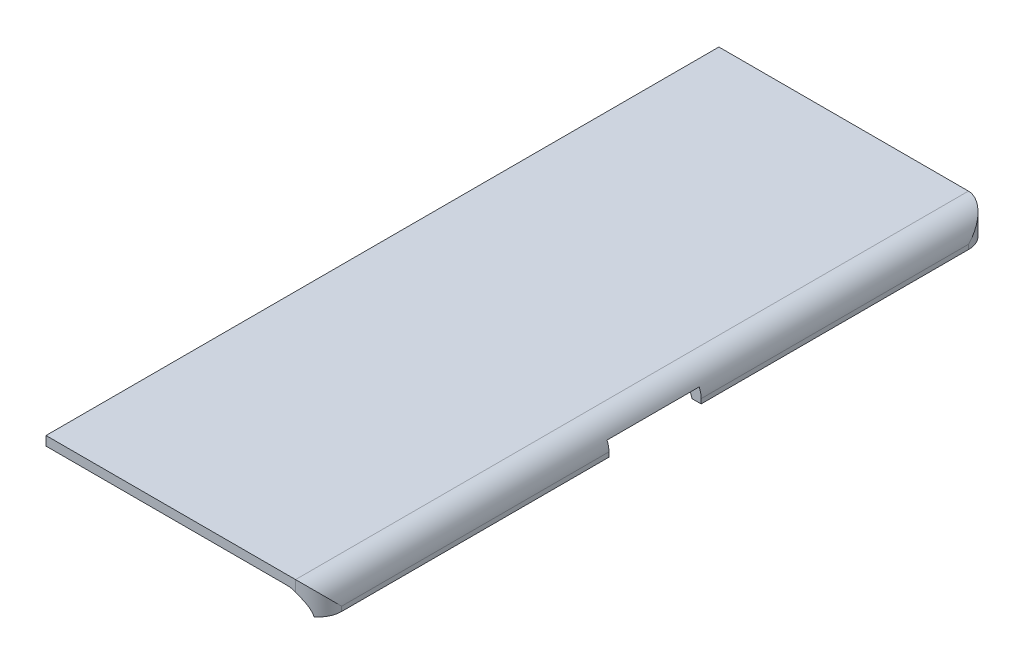
ISO-10303-21;
HEADER;
FILE_DESCRIPTION(('STEP AP214'),'2;1');
FILE_NAME('part.step','',(''),(''),'','','');
FILE_SCHEMA(('AUTOMOTIVE_DESIGN { 1 0 10303 214 1 1 1 1 }'));
ENDSEC;
DATA;
#1=APPLICATION_CONTEXT('core data for automotive mechanical design processes');
#2=APPLICATION_PROTOCOL_DEFINITION('international standard','automotive_design',2000,#1);
#3=PRODUCT_CONTEXT('',#1,'mechanical');
#4=PRODUCT('Part','Part','',(#3));
#5=PRODUCT_RELATED_PRODUCT_CATEGORY('part','',(#4));
#6=PRODUCT_DEFINITION_FORMATION('','',#4);
#7=PRODUCT_DEFINITION_CONTEXT('part definition',#1,'design');
#8=PRODUCT_DEFINITION('design','',#6,#7);
#9=PRODUCT_DEFINITION_SHAPE('','',#8);
#10=(LENGTH_UNIT() NAMED_UNIT(*) SI_UNIT(.MILLI.,.METRE.));
#11=(NAMED_UNIT(*) PLANE_ANGLE_UNIT() SI_UNIT($,.RADIAN.));
#12=(NAMED_UNIT(*) SI_UNIT($,.STERADIAN.) SOLID_ANGLE_UNIT());
#13=UNCERTAINTY_MEASURE_WITH_UNIT(LENGTH_MEASURE(1.E-05),#10,'distance_accuracy_value','');
#14=(GEOMETRIC_REPRESENTATION_CONTEXT(3) GLOBAL_UNCERTAINTY_ASSIGNED_CONTEXT((#13)) GLOBAL_UNIT_ASSIGNED_CONTEXT((#10,
#11,#12)) REPRESENTATION_CONTEXT('',''));
#15=CARTESIAN_POINT('',(0.,0.,0.));
#16=DIRECTION('',(0.,0.,1.));
#17=DIRECTION('',(1.,0.,0.));
#18=AXIS2_PLACEMENT_3D('',#15,#16,#17);
#19=CARTESIAN_POINT('',(2.,0.,0.));
#20=DIRECTION('',(1.,0.,0.));
#21=DIRECTION('',(0.,0.,-1.));
#22=AXIS2_PLACEMENT_3D('',#19,#20,#21);
#23=PLANE('',#22);
#24=DIRECTION('',(0.,1.,0.));
#25=VECTOR('',#24,1.);
#26=CARTESIAN_POINT('',(2.,2.,-141.));
#27=LINE('',#26,#25);
#28=CARTESIAN_POINT('',(2.,-4.,-141.));
#29=VERTEX_POINT('',#28);
#30=CARTESIAN_POINT('',(2.,-3.,-141.));
#31=VERTEX_POINT('',#30);
#32=EDGE_CURVE('E197',#29,#31,#27,.T.);
#33=ORIENTED_EDGE('',*,*,#32,.T.);
#34=DIRECTION('',(0.,0.,1.));
#35=VECTOR('',#34,1.);
#36=CARTESIAN_POINT('',(2.,-3.,0.));
#37=LINE('',#36,#35);
#38=CARTESIAN_POINT('',(2.,-3.,-83.));
#39=VERTEX_POINT('',#38);
#40=EDGE_CURVE('E157',#31,#39,#37,.T.);
#41=ORIENTED_EDGE('',*,*,#40,.T.);
#42=DIRECTION('',(0.,1.,0.));
#43=VECTOR('',#42,1.);
#44=CARTESIAN_POINT('',(2.,-6.99999999999999,-83.));
#45=LINE('',#44,#43);
#46=CARTESIAN_POINT('',(2.,-4.,-83.));
#47=VERTEX_POINT('',#46);
#48=EDGE_CURVE('E202',#47,#39,#45,.T.);
#49=ORIENTED_EDGE('',*,*,#48,.F.);
#50=DIRECTION('',(0.,0.,-1.));
#51=VECTOR('',#50,1.);
#52=CARTESIAN_POINT('',(2.,-4.,0.));
#53=LINE('',#52,#51);
#54=EDGE_CURVE('E217',#47,#29,#53,.T.);
#55=ORIENTED_EDGE('',*,*,#54,.T.);
#56=EDGE_LOOP('',(#33,#41,#49,#55));
#57=FACE_BOUND('',#56,.T.);
#58=ADVANCED_FACE('F42',(#57),#23,.T.);
#59=CARTESIAN_POINT('',(2.,-4.,0.));
#60=DIRECTION('',(0.,1.,0.));
#61=DIRECTION('',(0.,0.,1.));
#62=AXIS2_PLACEMENT_3D('',#59,#60,#61);
#63=PLANE('',#62);
#64=DIRECTION('',(-1.,0.,0.));
#65=VECTOR('',#64,1.);
#66=CARTESIAN_POINT('',(2.,-4.,-63.));
#67=LINE('',#66,#65);
#68=CARTESIAN_POINT('',(2.,-4.,-63.));
#69=VERTEX_POINT('',#68);
#70=CARTESIAN_POINT('',(0.,-4.,-63.));
#71=VERTEX_POINT('',#70);
#72=EDGE_CURVE('E209',#69,#71,#67,.T.);
#73=ORIENTED_EDGE('',*,*,#72,.F.);
#74=CARTESIAN_POINT('',(2.,-4.,-5.));
#75=VERTEX_POINT('',#74);
#76=EDGE_CURVE('E213',#75,#69,#53,.T.);
#77=ORIENTED_EDGE('',*,*,#76,.F.);
#78=CARTESIAN_POINT('',(-3.,-4.,-5.));
#79=DIRECTION('',(0.,1.,0.));
#80=DIRECTION('',(0.,0.,1.));
#81=AXIS2_PLACEMENT_3D('',#78,#79,#80);
#82=CIRCLE('',#81,5.);
#83=CARTESIAN_POINT('',(0.,-4.,-1.));
#84=VERTEX_POINT('',#83);
#85=EDGE_CURVE('E196',#75,#84,#82,.F.);
#86=ORIENTED_EDGE('',*,*,#85,.T.);
#87=DIRECTION('',(0.,0.,-1.));
#88=VECTOR('',#87,1.);
#89=CARTESIAN_POINT('',(0.,-4.,0.));
#90=LINE('',#89,#88);
#91=EDGE_CURVE('E218',#84,#71,#90,.T.);
#92=ORIENTED_EDGE('',*,*,#91,.T.);
#93=EDGE_LOOP('',(#73,#77,#86,#92));
#94=FACE_BOUND('',#93,.T.);
#95=ADVANCED_FACE('F289',(#94),#63,.F.);
#96=CARTESIAN_POINT('',(-57.15,2.,-146.));
#97=DIRECTION('',(1.,0.,0.));
#98=DIRECTION('',(0.,0.,-1.));
#99=AXIS2_PLACEMENT_3D('',#96,#97,#98);
#100=PLANE('',#99);
#101=DIRECTION('',(0.,0.,1.));
#102=VECTOR('',#101,1.);
#103=CARTESIAN_POINT('',(-57.15,0.,-146.));
#104=LINE('',#103,#102);
#105=CARTESIAN_POINT('',(-57.15,0.,-146.));
#106=VERTEX_POINT('',#105);
#107=CARTESIAN_POINT('',(-57.15,0.,0.));
#108=VERTEX_POINT('',#107);
#109=EDGE_CURVE('E216',#106,#108,#104,.T.);
#110=ORIENTED_EDGE('',*,*,#109,.T.);
#111=DIRECTION('',(0.,-1.,0.));
#112=VECTOR('',#111,1.);
#113=CARTESIAN_POINT('',(-57.15,2.,0.));
#114=LINE('',#113,#112);
#115=CARTESIAN_POINT('',(-57.15,2.,0.));
#116=VERTEX_POINT('',#115);
#117=EDGE_CURVE('E232',#116,#108,#114,.T.);
#118=ORIENTED_EDGE('',*,*,#117,.F.);
#119=DIRECTION('',(0.,0.,1.));
#120=VECTOR('',#119,1.);
#121=CARTESIAN_POINT('',(-57.15,2.,-146.));
#122=LINE('',#121,#120);
#123=CARTESIAN_POINT('',(-57.15,2.,-146.));
#124=VERTEX_POINT('',#123);
#125=EDGE_CURVE('E221',#124,#116,#122,.T.);
#126=ORIENTED_EDGE('',*,*,#125,.F.);
#127=DIRECTION('',(0.,-1.,0.));
#128=VECTOR('',#127,1.);
#129=CARTESIAN_POINT('',(-57.15,2.,-146.));
#130=LINE('',#129,#128);
#131=EDGE_CURVE('E186',#124,#106,#130,.T.);
#132=ORIENTED_EDGE('',*,*,#131,.T.);
#133=EDGE_LOOP('',(#110,#118,#126,#132));
#134=FACE_BOUND('',#133,.T.);
#135=ADVANCED_FACE('F263',(#134),#100,.F.);
#136=CARTESIAN_POINT('',(-57.15,2.,0.));
#137=DIRECTION('',(0.,0.,-1.));
#138=DIRECTION('',(-1.,0.,0.));
#139=AXIS2_PLACEMENT_3D('',#136,#137,#138);
#140=PLANE('',#139);
#141=DIRECTION('',(1.,0.,0.));
#142=VECTOR('',#141,1.);
#143=CARTESIAN_POINT('',(-57.15,0.,0.));
#144=LINE('',#143,#142);
#145=CARTESIAN_POINT('',(-4.89897948556636,0.,0.));
#146=VERTEX_POINT('',#145);
#147=EDGE_CURVE('E227',#108,#146,#144,.T.);
#148=ORIENTED_EDGE('',*,*,#147,.T.);
#149=CARTESIAN_POINT('',(-4.89897948556636,-5.,0.));
#150=DIRECTION('',(0.,0.,-1.));
#151=DIRECTION('',(-1.,0.,0.));
#152=AXIS2_PLACEMENT_3D('',#149,#150,#151);
#153=CIRCLE('',#152,5.);
#154=CARTESIAN_POINT('',(-3.,-0.374648455155204,0.));
#155=VERTEX_POINT('',#154);
#156=EDGE_CURVE('E273',#146,#155,#153,.T.);
#157=ORIENTED_EDGE('',*,*,#156,.T.);
#158=DIRECTION('',(0.,-1.,0.));
#159=VECTOR('',#158,1.);
#160=CARTESIAN_POINT('',(-3.,2.,0.));
#161=LINE('',#160,#159);
#162=CARTESIAN_POINT('',(-3.,2.,0.));
#163=VERTEX_POINT('',#162);
#164=EDGE_CURVE('E243',#155,#163,#161,.F.);
#165=ORIENTED_EDGE('',*,*,#164,.T.);
#166=DIRECTION('',(1.,0.,0.));
#167=VECTOR('',#166,1.);
#168=CARTESIAN_POINT('',(-57.15,2.,0.));
#169=LINE('',#168,#167);
#170=EDGE_CURVE('E176',#116,#163,#169,.T.);
#171=ORIENTED_EDGE('',*,*,#170,.F.);
#172=ORIENTED_EDGE('',*,*,#117,.T.);
#173=EDGE_LOOP('',(#148,#157,#165,#171,#172));
#174=FACE_BOUND('',#173,.T.);
#175=ADVANCED_FACE('F323',(#174),#140,.F.);
#176=CARTESIAN_POINT('',(-57.15,2.,-146.));
#177=DIRECTION('',(0.,0.,1.));
#178=DIRECTION('',(1.,0.,0.));
#179=AXIS2_PLACEMENT_3D('',#176,#177,#178);
#180=PLANE('',#179);
#181=DIRECTION('',(-1.,0.,0.));
#182=VECTOR('',#181,1.);
#183=CARTESIAN_POINT('',(-57.15,2.,-146.));
#184=LINE('',#183,#182);
#185=CARTESIAN_POINT('',(-3.,2.,-146.));
#186=VERTEX_POINT('',#185);
#187=EDGE_CURVE('E174',#186,#124,#184,.T.);
#188=ORIENTED_EDGE('',*,*,#187,.F.);
#189=DIRECTION('',(0.,1.,0.));
#190=VECTOR('',#189,1.);
#191=CARTESIAN_POINT('',(-3.,-4.,-146.));
#192=LINE('',#191,#190);
#193=CARTESIAN_POINT('',(-3.,-0.374648455155204,-146.));
#194=VERTEX_POINT('',#193);
#195=EDGE_CURVE('E183',#186,#194,#192,.F.);
#196=ORIENTED_EDGE('',*,*,#195,.T.);
#197=CARTESIAN_POINT('',(-4.89897948556636,-5.,-146.));
#198=DIRECTION('',(0.,0.,1.));
#199=DIRECTION('',(1.,0.,0.));
#200=AXIS2_PLACEMENT_3D('',#197,#198,#199);
#201=CIRCLE('',#200,5.);
#202=CARTESIAN_POINT('',(-4.89897948556636,0.,-146.));
#203=VERTEX_POINT('',#202);
#204=EDGE_CURVE('E254',#194,#203,#201,.T.);
#205=ORIENTED_EDGE('',*,*,#204,.T.);
#206=DIRECTION('',(-1.,0.,0.));
#207=VECTOR('',#206,1.);
#208=CARTESIAN_POINT('',(-57.15,0.,-146.));
#209=LINE('',#208,#207);
#210=EDGE_CURVE('E223',#203,#106,#209,.T.);
#211=ORIENTED_EDGE('',*,*,#210,.T.);
#212=ORIENTED_EDGE('',*,*,#131,.F.);
#213=EDGE_LOOP('',(#188,#196,#205,#211,#212));
#214=FACE_BOUND('',#213,.T.);
#215=ADVANCED_FACE('F182',(#214),#180,.F.);
#216=CARTESIAN_POINT('',(0.,2.,0.));
#217=DIRECTION('',(0.,1.,0.));
#218=DIRECTION('',(0.,0.,1.));
#219=AXIS2_PLACEMENT_3D('',#216,#217,#218);
#220=PLANE('',#219);
#221=ORIENTED_EDGE('',*,*,#170,.T.);
#222=DIRECTION('',(0.,0.,1.));
#223=VECTOR('',#222,1.);
#224=CARTESIAN_POINT('',(-3.,2.,0.));
#225=LINE('',#224,#223);
#226=EDGE_CURVE('E50',#163,#186,#225,.F.);
#227=ORIENTED_EDGE('',*,*,#226,.T.);
#228=ORIENTED_EDGE('',*,*,#187,.T.);
#229=ORIENTED_EDGE('',*,*,#125,.T.);
#230=EDGE_LOOP('',(#221,#227,#228,#229));
#231=FACE_BOUND('',#230,.T.);
#232=ADVANCED_FACE('F172',(#231),#220,.T.);
#233=CARTESIAN_POINT('',(0.,0.,0.));
#234=DIRECTION('',(0.,1.,0.));
#235=DIRECTION('',(0.,0.,1.));
#236=AXIS2_PLACEMENT_3D('',#233,#234,#235);
#237=PLANE('',#236);
#238=ORIENTED_EDGE('',*,*,#210,.F.);
#239=DIRECTION('',(0.,0.,1.));
#240=VECTOR('',#239,1.);
#241=CARTESIAN_POINT('',(-4.89897948556636,0.,0.));
#242=LINE('',#241,#240);
#243=EDGE_CURVE('E246',#203,#146,#242,.T.);
#244=ORIENTED_EDGE('',*,*,#243,.T.);
#245=ORIENTED_EDGE('',*,*,#147,.F.);
#246=ORIENTED_EDGE('',*,*,#109,.F.);
#247=EDGE_LOOP('',(#238,#244,#245,#246));
#248=FACE_BOUND('',#247,.T.);
#249=ADVANCED_FACE('F282',(#248),#237,.F.);
#250=ORIENTED_EDGE('',*,*,#54,.F.);
#251=DIRECTION('',(-1.,0.,0.));
#252=VECTOR('',#251,1.);
#253=CARTESIAN_POINT('',(2.,-4.,-83.));
#254=LINE('',#253,#252);
#255=CARTESIAN_POINT('',(0.,-4.,-83.));
#256=VERTEX_POINT('',#255);
#257=EDGE_CURVE('E204',#47,#256,#254,.T.);
#258=ORIENTED_EDGE('',*,*,#257,.T.);
#259=CARTESIAN_POINT('',(0.,-4.,-145.));
#260=VERTEX_POINT('',#259);
#261=EDGE_CURVE('E154',#256,#260,#90,.T.);
#262=ORIENTED_EDGE('',*,*,#261,.T.);
#263=CARTESIAN_POINT('',(-3.,-4.,-141.));
#264=DIRECTION('',(0.,1.,0.));
#265=DIRECTION('',(0.,0.,1.));
#266=AXIS2_PLACEMENT_3D('',#263,#264,#265);
#267=CIRCLE('',#266,5.);
#268=EDGE_CURVE('E240',#260,#29,#267,.F.);
#269=ORIENTED_EDGE('',*,*,#268,.T.);
#270=EDGE_LOOP('',(#250,#258,#262,#269));
#271=FACE_BOUND('',#270,.T.);
#272=ADVANCED_FACE('F309',(#271),#63,.F.);
#273=DIRECTION('',(0.,1.,0.));
#274=VECTOR('',#273,1.);
#275=CARTESIAN_POINT('',(2.,-7.,-63.));
#276=LINE('',#275,#274);
#277=CARTESIAN_POINT('',(2.,-3.,-63.));
#278=VERTEX_POINT('',#277);
#279=EDGE_CURVE('E149',#69,#278,#276,.T.);
#280=ORIENTED_EDGE('',*,*,#279,.T.);
#281=DIRECTION('',(0.,0.,1.));
#282=VECTOR('',#281,1.);
#283=CARTESIAN_POINT('',(2.,-3.,0.));
#284=LINE('',#283,#282);
#285=CARTESIAN_POINT('',(2.,-3.,-5.));
#286=VERTEX_POINT('',#285);
#287=EDGE_CURVE('E155',#278,#286,#284,.T.);
#288=ORIENTED_EDGE('',*,*,#287,.T.);
#289=DIRECTION('',(0.,-1.,0.));
#290=VECTOR('',#289,1.);
#291=CARTESIAN_POINT('',(2.,-4.,-5.));
#292=LINE('',#291,#290);
#293=EDGE_CURVE('E235',#286,#75,#292,.T.);
#294=ORIENTED_EDGE('',*,*,#293,.T.);
#295=ORIENTED_EDGE('',*,*,#76,.T.);
#296=EDGE_LOOP('',(#280,#288,#294,#295));
#297=FACE_BOUND('',#296,.T.);
#298=ADVANCED_FACE('F262',(#297),#23,.T.);
#299=CARTESIAN_POINT('',(-3.,0.,-141.));
#300=DIRECTION('',(0.,-1.,0.));
#301=DIRECTION('',(0.,0.,-1.));
#302=AXIS2_PLACEMENT_3D('',#299,#300,#301);
#303=CYLINDRICAL_SURFACE('',#302,5.);
#304=ORIENTED_EDGE('',*,*,#195,.F.);
#305=CARTESIAN_POINT('',(-3.,-3.,-141.));
#306=DIRECTION('',(0.,-0.707106781186547,-0.707106781186547));
#307=DIRECTION('',(0.,-0.707106781186547,0.707106781186547));
#308=AXIS2_PLACEMENT_3D('',#305,#306,#307);
#309=ELLIPSE('',#308,7.07106781186547,5.);
#310=EDGE_CURVE('E11',#186,#31,#309,.T.);
#311=ORIENTED_EDGE('',*,*,#310,.T.);
#312=ORIENTED_EDGE('',*,*,#32,.F.);
#313=ORIENTED_EDGE('',*,*,#268,.F.);
#314=CARTESIAN_POINT('',(0.,-4.,-145.));
#315=CARTESIAN_POINT('',(-0.0284049097773893,-3.86087108825998,-145.021272017249));
#316=CARTESIAN_POINT('',(-0.0625711517142736,-3.72371035092979,-145.046457367666));
#317=CARTESIAN_POINT('',(-0.141896301508468,-3.45407057674264,-145.102886307482));
#318=CARTESIAN_POINT('',(-0.187041003837111,-3.32158574118855,-145.134122057451));
#319=CARTESIAN_POINT('',(-0.338427709354307,-2.9313559204261,-145.23445577138));
#320=CARTESIAN_POINT('',(-0.460537862755194,-2.68123908633951,-145.310109065019));
#321=CARTESIAN_POINT('',(-0.672388339353728,-2.32512586420988,-145.425912359974));
#322=CARTESIAN_POINT('',(-0.747660882804053,-2.2097464948925,-145.46484464804));
#323=CARTESIAN_POINT('',(-0.907575517988905,-1.9854219707111,-145.541987717971));
#324=CARTESIAN_POINT('',(-0.992217694255993,-1.87647687391049,-145.580198493324));
#325=CARTESIAN_POINT('',(-1.25940597553134,-1.56063464611638,-145.691196413603));
#326=CARTESIAN_POINT('',(-1.45577920594714,-1.36377847257579,-145.760681319526));
#327=CARTESIAN_POINT('',(-1.76649734802821,-1.10076793620763,-145.84652529257));
#328=CARTESIAN_POINT('',(-1.86776870978576,-1.02150491584606,-145.871292557051));
#329=CARTESIAN_POINT('',(-2.07693150357165,-0.870513711866721,-145.915215645852));
#330=CARTESIAN_POINT('',(-2.18482003246354,-0.798782260871552,-145.934373909999));
#331=CARTESIAN_POINT('',(-2.40753344098372,-0.662970131229503,-145.966056981027));
#332=CARTESIAN_POINT('',(-2.5224091209113,-0.598959035707502,-145.978524514608));
#333=CARTESIAN_POINT('',(-2.75748645157306,-0.479880533187128,-145.995514279717));
#334=CARTESIAN_POINT('',(-2.87769625990176,-0.424827471085734,-146.000023879339));
#335=CARTESIAN_POINT('',(-3.,-0.374648455155204,-146.));
#336=B_SPLINE_CURVE_WITH_KNOTS('',3,(#314,#315,#316,#317,#318,#319,#320,#321,#322,#323,#324,
#325,#326,#327,#328,#329,#330,#331,#332,#333,#334,#335),.UNSPECIFIED.,.F.,.F.,(4,2,2,2,2,2,2,2,
2,2,4),(0.,0.430253412692585,0.859953035824528,1.72058982592876,2.14971020157182,
2.57883444904233,3.43365150258665,3.82616881599991,4.21851513612407,4.61416847189403,
5.01044927897818),.UNSPECIFIED.);
#337=EDGE_CURVE('E194',#260,#194,#336,.T.);
#338=ORIENTED_EDGE('',*,*,#337,.T.);
#339=EDGE_LOOP('',(#304,#311,#312,#313,#338));
#340=FACE_BOUND('',#339,.T.);
#341=ADVANCED_FACE('F190',(#340),#303,.T.);
#342=CARTESIAN_POINT('',(-3.,0.,-5.));
#343=DIRECTION('',(0.,1.,0.));
#344=DIRECTION('',(0.,0.,1.));
#345=AXIS2_PLACEMENT_3D('',#342,#343,#344);
#346=CYLINDRICAL_SURFACE('',#345,5.);
#347=ORIENTED_EDGE('',*,*,#293,.F.);
#348=CARTESIAN_POINT('',(-3.,-3.,-5.));
#349=DIRECTION('',(0.,0.707106781186547,-0.707106781186547));
#350=DIRECTION('',(0.,0.707106781186547,0.707106781186547));
#351=AXIS2_PLACEMENT_3D('',#348,#349,#350);
#352=ELLIPSE('',#351,7.07106781186547,5.);
#353=EDGE_CURVE('E167',#286,#163,#352,.F.);
#354=ORIENTED_EDGE('',*,*,#353,.T.);
#355=ORIENTED_EDGE('',*,*,#164,.F.);
#356=CARTESIAN_POINT('',(-3.,-0.374648455155204,0.));
#357=CARTESIAN_POINT('',(-2.88100971702315,-0.423469631262034,2.21441952962693E-05));
#358=CARTESIAN_POINT('',(-2.76399511912822,-0.476905430155834,-0.00424592101598203));
#359=CARTESIAN_POINT('',(-2.53498082053627,-0.592296624756604,-0.0203560680081054));
#360=CARTESIAN_POINT('',(-2.42297433505336,-0.654240000725068,-0.0321875486783084));
#361=CARTESIAN_POINT('',(-2.20570961539719,-0.785468141249594,-0.0622840476449573));
#362=CARTESIAN_POINT('',(-2.10039862116537,-0.854679838906336,-0.080488653894508));
#363=CARTESIAN_POINT('',(-1.89598452700939,-1.00027762119515,-0.122291356788613));
#364=CARTESIAN_POINT('',(-1.79688350157004,-1.07666608220248,-0.145891243656446));
#365=CARTESIAN_POINT('',(-1.51068082863184,-1.3147934565879,-0.222891297513946));
#366=CARTESIAN_POINT('',(-1.3333202121261,-1.4863236381332,-0.282705248721305));
#367=CARTESIAN_POINT('',(-1.00641726429887,-1.85222502745739,-0.411249457491417));
#368=CARTESIAN_POINT('',(-0.856987345732905,-2.04668360688834,-0.480013932797147));
#369=CARTESIAN_POINT('',(-0.645828871246238,-2.36747543985021,-0.58804798137848));
#370=CARTESIAN_POINT('',(-0.573971720423992,-2.48726059078486,-0.627319713509848));
#371=CARTESIAN_POINT('',(-0.4402986631765,-2.73290522835981,-0.704202900249352));
#372=CARTESIAN_POINT('',(-0.378485569207834,-2.85876640360715,-0.741813887689394));
#373=CARTESIAN_POINT('',(-0.265561936427242,-3.1155777326223,-0.813437866308746));
#374=CARTESIAN_POINT('',(-0.214411292193066,-3.24650653671323,-0.847464093015431));
#375=CARTESIAN_POINT('',(-0.1230479393926,-3.51328595004281,-0.910228461168046));
#376=CARTESIAN_POINT('',(-0.0828262665720408,-3.64913242138383,-0.938970930204927));
#377=CARTESIAN_POINT('',(-0.0307158194296654,-3.85750222854418,-0.977089252966289));
#378=CARTESIAN_POINT('',(-0.0145887695799405,-3.92851526996301,-0.989063514288785));
#379=CARTESIAN_POINT('',(0.,-4.00000000000006,-0.999999999999584));
#380=B_SPLINE_CURVE_WITH_KNOTS('',3,(#356,#357,#358,#359,#360,#361,#362,#363,#364,#365,#366,
#367,#368,#369,#370,#371,#372,#373,#374,#375,#376,#377,#378,#379),.UNSPECIFIED.,.F.,.F.,(4,2,2,
2,2,2,2,2,2,2,2,4),(0.,0.385569783561532,0.77060032231765,1.15207572474514,1.53367788979246,
2.29212161874247,3.0535550551018,3.48844529547311,3.92345710126682,4.35680190319639,
4.78979018296858,5.01109973933951),.UNSPECIFIED.);
#381=EDGE_CURVE('E144',#155,#84,#380,.T.);
#382=ORIENTED_EDGE('',*,*,#381,.T.);
#383=ORIENTED_EDGE('',*,*,#85,.F.);
#384=EDGE_LOOP('',(#347,#354,#355,#382,#383));
#385=FACE_BOUND('',#384,.T.);
#386=ADVANCED_FACE('F261',(#385),#346,.T.);
#387=CARTESIAN_POINT('',(-4.89897948556636,-5.,0.));
#388=DIRECTION('',(0.,0.,1.));
#389=DIRECTION('',(1.,0.,0.));
#390=AXIS2_PLACEMENT_3D('',#387,#388,#389);
#391=CYLINDRICAL_SURFACE('',#390,5.);
#392=ORIENTED_EDGE('',*,*,#261,.F.);
#393=CARTESIAN_POINT('',(-4.89897948556636,-5.,-83.));
#394=DIRECTION('',(0.,0.,-1.));
#395=DIRECTION('',(-1.,0.,0.));
#396=AXIS2_PLACEMENT_3D('',#393,#394,#395);
#397=CIRCLE('',#396,5.);
#398=CARTESIAN_POINT('',(-1.89897948556635,-0.999999999999995,-83.));
#399=VERTEX_POINT('',#398);
#400=EDGE_CURVE('E147',#256,#399,#397,.F.);
#401=ORIENTED_EDGE('',*,*,#400,.T.);
#402=DIRECTION('',(0.,0.,1.));
#403=VECTOR('',#402,1.);
#404=CARTESIAN_POINT('',(-1.89897948556635,-1.00000000000001,0.));
#405=LINE('',#404,#403);
#406=CARTESIAN_POINT('',(-1.89897948556635,-1.00000000000001,-63.));
#407=VERTEX_POINT('',#406);
#408=EDGE_CURVE('E135',#399,#407,#405,.T.);
#409=ORIENTED_EDGE('',*,*,#408,.T.);
#410=CARTESIAN_POINT('',(-4.89897948556636,-5.,-63.));
#411=DIRECTION('',(0.,0.,-1.));
#412=DIRECTION('',(-1.,0.,0.));
#413=AXIS2_PLACEMENT_3D('',#410,#411,#412);
#414=CIRCLE('',#413,5.);
#415=EDGE_CURVE('E143',#71,#407,#414,.F.);
#416=ORIENTED_EDGE('',*,*,#415,.F.);
#417=ORIENTED_EDGE('',*,*,#91,.F.);
#418=ORIENTED_EDGE('',*,*,#381,.F.);
#419=ORIENTED_EDGE('',*,*,#156,.F.);
#420=ORIENTED_EDGE('',*,*,#243,.F.);
#421=ORIENTED_EDGE('',*,*,#204,.F.);
#422=ORIENTED_EDGE('',*,*,#337,.F.);
#423=EDGE_LOOP('',(#392,#401,#409,#416,#417,#418,#419,#420,#421,#422));
#424=FACE_BOUND('',#423,.T.);
#425=ADVANCED_FACE('F152',(#424),#391,.F.);
#426=CARTESIAN_POINT('',(-8.,-6.99999999999999,-83.));
#427=DIRECTION('',(0.,0.,-1.));
#428=DIRECTION('',(-1.,0.,0.));
#429=AXIS2_PLACEMENT_3D('',#426,#427,#428);
#430=PLANE('',#429);
#431=ORIENTED_EDGE('',*,*,#48,.T.);
#432=CARTESIAN_POINT('',(-3.,-3.,-83.));
#433=DIRECTION('',(0.,0.,-1.));
#434=DIRECTION('',(-1.,0.,0.));
#435=AXIS2_PLACEMENT_3D('',#432,#433,#434);
#436=CIRCLE('',#435,5.);
#437=CARTESIAN_POINT('',(1.58257569495584,-0.999999999999995,-83.));
#438=VERTEX_POINT('',#437);
#439=EDGE_CURVE('E65',#39,#438,#436,.F.);
#440=ORIENTED_EDGE('',*,*,#439,.T.);
#441=DIRECTION('',(1.,0.,0.));
#442=VECTOR('',#441,1.);
#443=CARTESIAN_POINT('',(-8.,-0.999999999999995,-83.));
#444=LINE('',#443,#442);
#445=EDGE_CURVE('E137',#399,#438,#444,.T.);
#446=ORIENTED_EDGE('',*,*,#445,.F.);
#447=ORIENTED_EDGE('',*,*,#400,.F.);
#448=ORIENTED_EDGE('',*,*,#257,.F.);
#449=EDGE_LOOP('',(#431,#440,#446,#447,#448));
#450=FACE_BOUND('',#449,.T.);
#451=ADVANCED_FACE('F146',(#450),#430,.F.);
#452=CARTESIAN_POINT('',(-8.,-7.,-63.));
#453=DIRECTION('',(0.,0.,-1.));
#454=DIRECTION('',(-1.,0.,0.));
#455=AXIS2_PLACEMENT_3D('',#452,#453,#454);
#456=PLANE('',#455);
#457=DIRECTION('',(1.,0.,0.));
#458=VECTOR('',#457,1.);
#459=CARTESIAN_POINT('',(-8.,-0.999999999999997,-63.));
#460=LINE('',#459,#458);
#461=CARTESIAN_POINT('',(1.58257569495584,-0.999999999999997,-63.));
#462=VERTEX_POINT('',#461);
#463=EDGE_CURVE('E138',#407,#462,#460,.T.);
#464=ORIENTED_EDGE('',*,*,#463,.T.);
#465=CARTESIAN_POINT('',(-3.,-3.,-63.));
#466=DIRECTION('',(0.,0.,-1.));
#467=DIRECTION('',(-1.,0.,0.));
#468=AXIS2_PLACEMENT_3D('',#465,#466,#467);
#469=CIRCLE('',#468,5.);
#470=EDGE_CURVE('E165',#462,#278,#469,.T.);
#471=ORIENTED_EDGE('',*,*,#470,.T.);
#472=ORIENTED_EDGE('',*,*,#279,.F.);
#473=ORIENTED_EDGE('',*,*,#72,.T.);
#474=ORIENTED_EDGE('',*,*,#415,.T.);
#475=EDGE_LOOP('',(#464,#471,#472,#473,#474));
#476=FACE_BOUND('',#475,.T.);
#477=ADVANCED_FACE('F294',(#476),#456,.T.);
#478=CARTESIAN_POINT('',(-8.,-0.999999999999995,-83.));
#479=DIRECTION('',(0.,1.,0.));
#480=DIRECTION('',(0.,0.,1.));
#481=AXIS2_PLACEMENT_3D('',#478,#479,#480);
#482=PLANE('',#481);
#483=ORIENTED_EDGE('',*,*,#445,.T.);
#484=DIRECTION('',(0.,0.,1.));
#485=VECTOR('',#484,1.);
#486=CARTESIAN_POINT('',(1.58257569495584,-0.999999999999995,-83.));
#487=LINE('',#486,#485);
#488=EDGE_CURVE('E57',#438,#462,#487,.T.);
#489=ORIENTED_EDGE('',*,*,#488,.T.);
#490=ORIENTED_EDGE('',*,*,#463,.F.);
#491=ORIENTED_EDGE('',*,*,#408,.F.);
#492=EDGE_LOOP('',(#483,#489,#490,#491));
#493=FACE_BOUND('',#492,.T.);
#494=ADVANCED_FACE('F136',(#493),#482,.F.);
#495=CARTESIAN_POINT('',(-3.,-3.,0.));
#496=DIRECTION('',(0.,0.,1.));
#497=DIRECTION('',(1.,0.,0.));
#498=AXIS2_PLACEMENT_3D('',#495,#496,#497);
#499=CYLINDRICAL_SURFACE('',#498,5.);
#500=ORIENTED_EDGE('',*,*,#310,.F.);
#501=ORIENTED_EDGE('',*,*,#226,.F.);
#502=ORIENTED_EDGE('',*,*,#353,.F.);
#503=ORIENTED_EDGE('',*,*,#287,.F.);
#504=ORIENTED_EDGE('',*,*,#470,.F.);
#505=ORIENTED_EDGE('',*,*,#488,.F.);
#506=ORIENTED_EDGE('',*,*,#439,.F.);
#507=ORIENTED_EDGE('',*,*,#40,.F.);
#508=EDGE_LOOP('',(#500,#501,#502,#503,#504,#505,#506,#507));
#509=FACE_BOUND('',#508,.T.);
#510=ADVANCED_FACE('F44',(#509),#499,.T.);
#511=CLOSED_SHELL('',(#58,#95,#135,#175,#215,#232,#249,#272,#298,#341,#386,#425,#451,#477,#494,#510));
#512=MANIFOLD_SOLID_BREP('B2',#511);
#513=ADVANCED_BREP_SHAPE_REPRESENTATION('',(#18,#512),#14);
#514=SHAPE_DEFINITION_REPRESENTATION(#9,#513);
ENDSEC;
END-ISO-10303-21;
